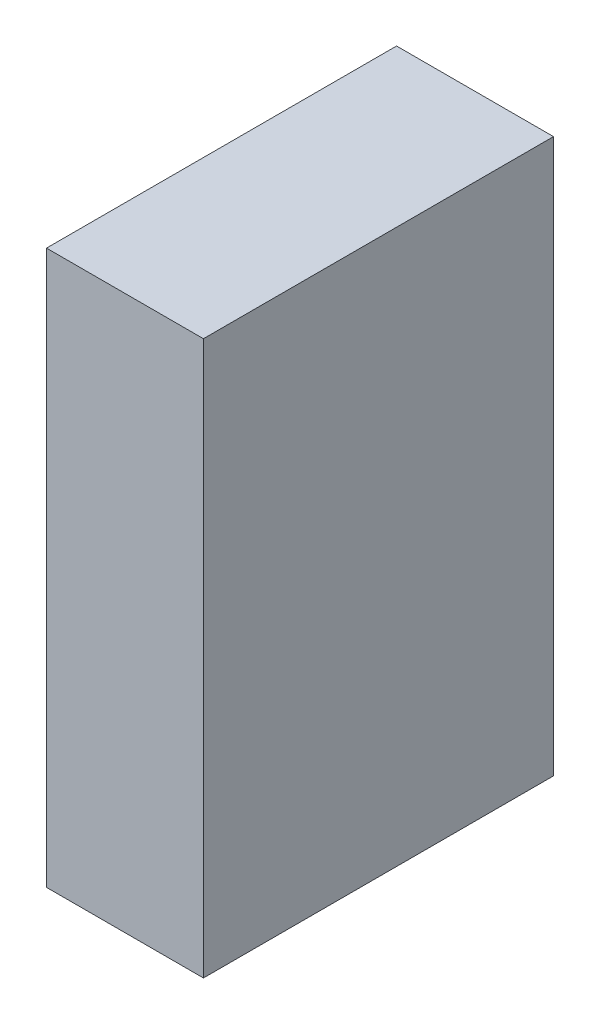
ISO-10303-21;
HEADER;
FILE_DESCRIPTION(('STEP AP214'),'2;1');
FILE_NAME('part.step','',(''),(''),'','','');
FILE_SCHEMA(('AUTOMOTIVE_DESIGN { 1 0 10303 214 1 1 1 1 }'));
ENDSEC;
DATA;
#1=APPLICATION_CONTEXT('core data for automotive mechanical design processes');
#2=APPLICATION_PROTOCOL_DEFINITION('international standard','automotive_design',2000,#1);
#3=PRODUCT_CONTEXT('',#1,'mechanical');
#4=PRODUCT('Part','Part','',(#3));
#5=PRODUCT_RELATED_PRODUCT_CATEGORY('part','',(#4));
#6=PRODUCT_DEFINITION_FORMATION('','',#4);
#7=PRODUCT_DEFINITION_CONTEXT('part definition',#1,'design');
#8=PRODUCT_DEFINITION('design','',#6,#7);
#9=PRODUCT_DEFINITION_SHAPE('','',#8);
#10=(LENGTH_UNIT() NAMED_UNIT(*) SI_UNIT(.MILLI.,.METRE.));
#11=(NAMED_UNIT(*) PLANE_ANGLE_UNIT() SI_UNIT($,.RADIAN.));
#12=(NAMED_UNIT(*) SI_UNIT($,.STERADIAN.) SOLID_ANGLE_UNIT());
#13=UNCERTAINTY_MEASURE_WITH_UNIT(LENGTH_MEASURE(1.E-05),#10,'distance_accuracy_value','');
#14=(GEOMETRIC_REPRESENTATION_CONTEXT(3) GLOBAL_UNCERTAINTY_ASSIGNED_CONTEXT((#13)) GLOBAL_UNIT_ASSIGNED_CONTEXT((#10,
#11,#12)) REPRESENTATION_CONTEXT('',''));
#15=CARTESIAN_POINT('',(0.,0.,0.));
#16=DIRECTION('',(0.,0.,1.));
#17=DIRECTION('',(1.,0.,0.));
#18=AXIS2_PLACEMENT_3D('',#15,#16,#17);
#19=CARTESIAN_POINT('',(-0.13449046,-0.47448978,0.));
#20=DIRECTION('',(-1.,0.,0.));
#21=DIRECTION('',(0.,1.,0.));
#22=AXIS2_PLACEMENT_3D('',#19,#20,#21);
#23=PLANE('',#22);
#24=DIRECTION('',(0.,0.,1.));
#25=VECTOR('',#24,1.);
#26=CARTESIAN_POINT('',(-0.13449046,-0.47448978,0.));
#27=LINE('',#26,#25);
#28=CARTESIAN_POINT('',(-0.13449046,-0.47448978,0.));
#29=VERTEX_POINT('',#28);
#30=CARTESIAN_POINT('',(-0.13449046,-0.47448978,0.5999988));
#31=VERTEX_POINT('',#30);
#32=EDGE_CURVE('E11',#29,#31,#27,.T.);
#33=ORIENTED_EDGE('',*,*,#32,.T.);
#34=DIRECTION('',(0.,1.,0.));
#35=VECTOR('',#34,1.);
#36=CARTESIAN_POINT('',(-0.13449046,-0.47448978,0.5999988));
#37=LINE('',#36,#35);
#38=CARTESIAN_POINT('',(-0.13449046,0.47449232,0.5999988));
#39=VERTEX_POINT('',#38);
#40=EDGE_CURVE('E24',#31,#39,#37,.T.);
#41=ORIENTED_EDGE('',*,*,#40,.T.);
#42=DIRECTION('',(0.,0.,1.));
#43=VECTOR('',#42,1.);
#44=CARTESIAN_POINT('',(-0.13449046,0.47449232,0.));
#45=LINE('',#44,#43);
#46=CARTESIAN_POINT('',(-0.13449046,0.47449232,0.));
#47=VERTEX_POINT('',#46);
#48=EDGE_CURVE('E85',#47,#39,#45,.T.);
#49=ORIENTED_EDGE('',*,*,#48,.F.);
#50=DIRECTION('',(0.,1.,0.));
#51=VECTOR('',#50,1.);
#52=CARTESIAN_POINT('',(-0.13449046,-0.47448978,0.));
#53=LINE('',#52,#51);
#54=EDGE_CURVE('E83',#29,#47,#53,.T.);
#55=ORIENTED_EDGE('',*,*,#54,.F.);
#56=EDGE_LOOP('',(#33,#41,#49,#55));
#57=FACE_BOUND('',#56,.T.);
#58=ADVANCED_FACE('F17',(#57),#23,.T.);
#59=CARTESIAN_POINT('',(-0.13449046,0.47449232,0.));
#60=DIRECTION('',(0.,1.,0.));
#61=DIRECTION('',(1.,0.,0.));
#62=AXIS2_PLACEMENT_3D('',#59,#60,#61);
#63=PLANE('',#62);
#64=ORIENTED_EDGE('',*,*,#48,.T.);
#65=DIRECTION('',(1.,0.,0.));
#66=VECTOR('',#65,1.);
#67=CARTESIAN_POINT('',(-0.13449046,0.47449232,0.5999988));
#68=LINE('',#67,#66);
#69=CARTESIAN_POINT('',(0.134493,0.47449232,0.5999988));
#70=VERTEX_POINT('',#69);
#71=EDGE_CURVE('E81',#39,#70,#68,.T.);
#72=ORIENTED_EDGE('',*,*,#71,.T.);
#73=DIRECTION('',(0.,0.,1.));
#74=VECTOR('',#73,1.);
#75=CARTESIAN_POINT('',(0.134493,0.47449232,0.));
#76=LINE('',#75,#74);
#77=CARTESIAN_POINT('',(0.134493,0.47449232,0.));
#78=VERTEX_POINT('',#77);
#79=EDGE_CURVE('E79',#78,#70,#76,.T.);
#80=ORIENTED_EDGE('',*,*,#79,.F.);
#81=DIRECTION('',(1.,0.,0.));
#82=VECTOR('',#81,1.);
#83=CARTESIAN_POINT('',(-0.13449046,0.47449232,0.));
#84=LINE('',#83,#82);
#85=EDGE_CURVE('E70',#47,#78,#84,.T.);
#86=ORIENTED_EDGE('',*,*,#85,.F.);
#87=EDGE_LOOP('',(#64,#72,#80,#86));
#88=FACE_BOUND('',#87,.T.);
#89=ADVANCED_FACE('F90',(#88),#63,.T.);
#90=CARTESIAN_POINT('',(0.134493,0.47449232,0.));
#91=DIRECTION('',(1.,0.,0.));
#92=DIRECTION('',(0.,-1.,0.));
#93=AXIS2_PLACEMENT_3D('',#90,#91,#92);
#94=PLANE('',#93);
#95=ORIENTED_EDGE('',*,*,#79,.T.);
#96=DIRECTION('',(0.,-1.,0.));
#97=VECTOR('',#96,1.);
#98=CARTESIAN_POINT('',(0.134493,0.47449232,0.5999988));
#99=LINE('',#98,#97);
#100=CARTESIAN_POINT('',(0.134493,-0.47448978,0.5999988));
#101=VERTEX_POINT('',#100);
#102=EDGE_CURVE('E60',#70,#101,#99,.T.);
#103=ORIENTED_EDGE('',*,*,#102,.T.);
#104=DIRECTION('',(0.,0.,1.));
#105=VECTOR('',#104,1.);
#106=CARTESIAN_POINT('',(0.134493,-0.47448978,0.));
#107=LINE('',#106,#105);
#108=CARTESIAN_POINT('',(0.134493,-0.47448978,0.));
#109=VERTEX_POINT('',#108);
#110=EDGE_CURVE('E54',#109,#101,#107,.T.);
#111=ORIENTED_EDGE('',*,*,#110,.F.);
#112=DIRECTION('',(0.,-1.,0.));
#113=VECTOR('',#112,1.);
#114=CARTESIAN_POINT('',(0.134493,0.47449232,0.));
#115=LINE('',#114,#113);
#116=EDGE_CURVE('E58',#78,#109,#115,.T.);
#117=ORIENTED_EDGE('',*,*,#116,.F.);
#118=EDGE_LOOP('',(#95,#103,#111,#117));
#119=FACE_BOUND('',#118,.T.);
#120=ADVANCED_FACE('F57',(#119),#94,.T.);
#121=CARTESIAN_POINT('',(0.134493,-0.47448978,0.));
#122=DIRECTION('',(0.,-1.,0.));
#123=DIRECTION('',(-1.,0.,0.));
#124=AXIS2_PLACEMENT_3D('',#121,#122,#123);
#125=PLANE('',#124);
#126=ORIENTED_EDGE('',*,*,#110,.T.);
#127=DIRECTION('',(-1.,0.,0.));
#128=VECTOR('',#127,1.);
#129=CARTESIAN_POINT('',(0.134493,-0.47448978,0.5999988));
#130=LINE('',#129,#128);
#131=EDGE_CURVE('E71',#101,#31,#130,.T.);
#132=ORIENTED_EDGE('',*,*,#131,.T.);
#133=ORIENTED_EDGE('',*,*,#32,.F.);
#134=DIRECTION('',(-1.,0.,0.));
#135=VECTOR('',#134,1.);
#136=CARTESIAN_POINT('',(0.134493,-0.47448978,0.));
#137=LINE('',#136,#135);
#138=EDGE_CURVE('E68',#109,#29,#137,.T.);
#139=ORIENTED_EDGE('',*,*,#138,.F.);
#140=EDGE_LOOP('',(#126,#132,#133,#139));
#141=FACE_BOUND('',#140,.T.);
#142=ADVANCED_FACE('F73',(#141),#125,.T.);
#143=CARTESIAN_POINT('',(-0.13449046,-0.47448978,0.));
#144=DIRECTION('',(0.,0.,1.));
#145=DIRECTION('',(1.,0.,0.));
#146=AXIS2_PLACEMENT_3D('',#143,#144,#145);
#147=PLANE('',#146);
#148=ORIENTED_EDGE('',*,*,#54,.T.);
#149=ORIENTED_EDGE('',*,*,#85,.T.);
#150=ORIENTED_EDGE('',*,*,#116,.T.);
#151=ORIENTED_EDGE('',*,*,#138,.T.);
#152=EDGE_LOOP('',(#148,#149,#150,#151));
#153=FACE_BOUND('',#152,.T.);
#154=ADVANCED_FACE('F67',(#153),#147,.F.);
#155=CARTESIAN_POINT('',(-0.13449046,-0.47448978,0.5999988));
#156=DIRECTION('',(0.,0.,1.));
#157=DIRECTION('',(1.,0.,0.));
#158=AXIS2_PLACEMENT_3D('',#155,#156,#157);
#159=PLANE('',#158);
#160=ORIENTED_EDGE('',*,*,#131,.F.);
#161=ORIENTED_EDGE('',*,*,#102,.F.);
#162=ORIENTED_EDGE('',*,*,#71,.F.);
#163=ORIENTED_EDGE('',*,*,#40,.F.);
#164=EDGE_LOOP('',(#160,#161,#162,#163));
#165=FACE_BOUND('',#164,.T.);
#166=ADVANCED_FACE('F91',(#165),#159,.T.);
#167=CLOSED_SHELL('',(#58,#89,#120,#142,#154,#166));
#168=MANIFOLD_SOLID_BREP('B1',#167);
#169=ADVANCED_BREP_SHAPE_REPRESENTATION('',(#18,#168),#14);
#170=SHAPE_DEFINITION_REPRESENTATION(#9,#169);
ENDSEC;
END-ISO-10303-21;
